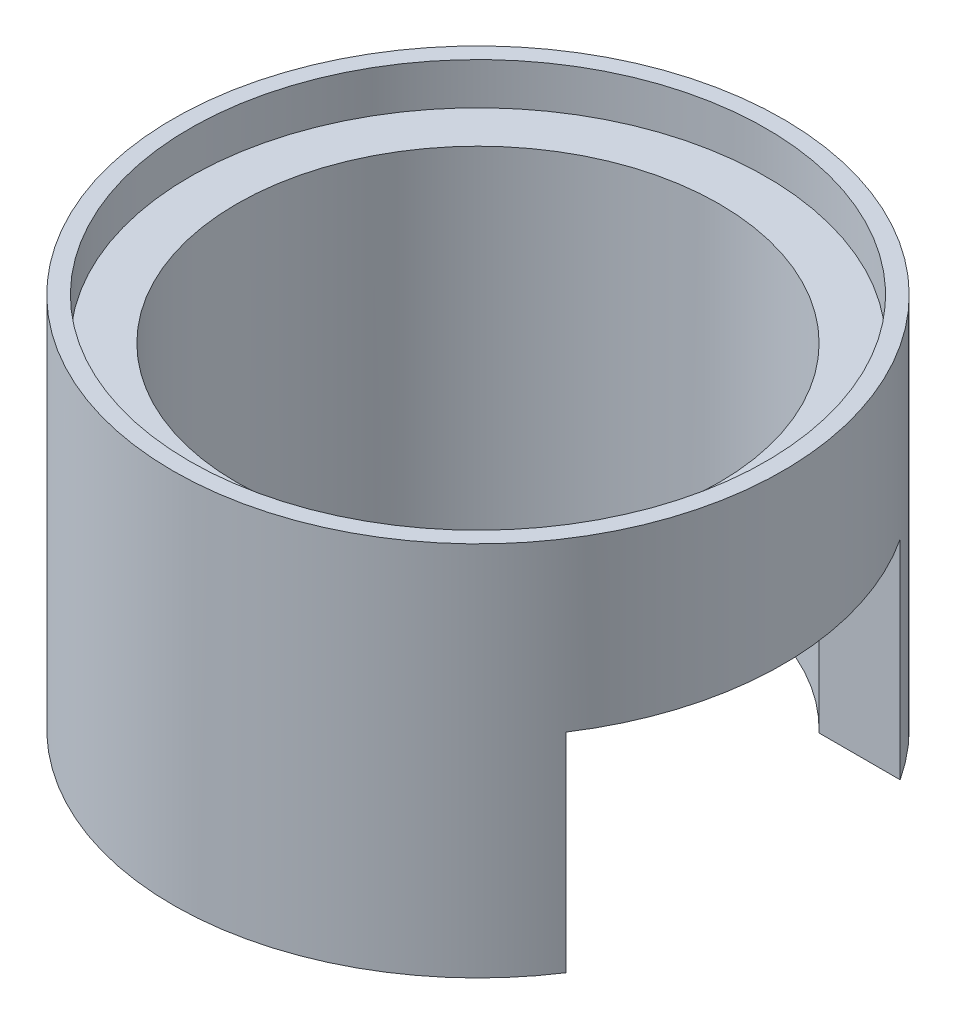
ISO-10303-21;
HEADER;
FILE_DESCRIPTION(('STEP AP214'),'2;1');
FILE_NAME('part.step','',(''),(''),'','','');
FILE_SCHEMA(('AUTOMOTIVE_DESIGN { 1 0 10303 214 1 1 1 1 }'));
ENDSEC;
DATA;
#1=APPLICATION_CONTEXT('core data for automotive mechanical design processes');
#2=APPLICATION_PROTOCOL_DEFINITION('international standard','automotive_design',2000,#1);
#3=PRODUCT_CONTEXT('',#1,'mechanical');
#4=PRODUCT('Part','Part','',(#3));
#5=PRODUCT_RELATED_PRODUCT_CATEGORY('part','',(#4));
#6=PRODUCT_DEFINITION_FORMATION('','',#4);
#7=PRODUCT_DEFINITION_CONTEXT('part definition',#1,'design');
#8=PRODUCT_DEFINITION('design','',#6,#7);
#9=PRODUCT_DEFINITION_SHAPE('','',#8);
#10=(LENGTH_UNIT() NAMED_UNIT(*) SI_UNIT(.MILLI.,.METRE.));
#11=(NAMED_UNIT(*) PLANE_ANGLE_UNIT() SI_UNIT($,.RADIAN.));
#12=(NAMED_UNIT(*) SI_UNIT($,.STERADIAN.) SOLID_ANGLE_UNIT());
#13=UNCERTAINTY_MEASURE_WITH_UNIT(LENGTH_MEASURE(1.E-05),#10,'distance_accuracy_value','');
#14=(GEOMETRIC_REPRESENTATION_CONTEXT(3) GLOBAL_UNCERTAINTY_ASSIGNED_CONTEXT((#13)) GLOBAL_UNIT_ASSIGNED_CONTEXT((#10,
#11,#12)) REPRESENTATION_CONTEXT('',''));
#15=CARTESIAN_POINT('',(0.,0.,0.));
#16=DIRECTION('',(0.,0.,1.));
#17=DIRECTION('',(1.,0.,0.));
#18=AXIS2_PLACEMENT_3D('',#15,#16,#17);
#19=CARTESIAN_POINT('',(0.,9.,0.));
#20=DIRECTION('',(0.,-1.,0.));
#21=DIRECTION('',(0.,0.,-1.));
#22=AXIS2_PLACEMENT_3D('',#19,#20,#21);
#23=CYLINDRICAL_SURFACE('',#22,7.3);
#24=CARTESIAN_POINT('',(0.,9.,0.));
#25=DIRECTION('',(0.,1.,0.));
#26=DIRECTION('',(0.,0.,1.));
#27=AXIS2_PLACEMENT_3D('',#24,#25,#26);
#28=CIRCLE('',#27,7.3);
#29=CARTESIAN_POINT('',(0.,9.,7.3));
#30=VERTEX_POINT('',#29);
#31=EDGE_CURVE('E88',#30,#30,#28,.T.);
#32=ORIENTED_EDGE('',*,*,#31,.F.);
#33=EDGE_LOOP('',(#32));
#34=FACE_BOUND('',#33,.T.);
#35=CARTESIAN_POINT('',(0.,4.98921657471197,0.));
#36=DIRECTION('',(0.,-1.,0.));
#37=DIRECTION('',(0.,0.,-1.));
#38=AXIS2_PLACEMENT_3D('',#35,#36,#37);
#39=CIRCLE('',#38,7.3);
#40=CARTESIAN_POINT('',(6.10655385630881,4.98921657471197,-4.));
#41=VERTEX_POINT('',#40);
#42=CARTESIAN_POINT('',(6.10655385630881,4.98921657471197,4.));
#43=VERTEX_POINT('',#42);
#44=EDGE_CURVE('E93',#41,#43,#39,.T.);
#45=ORIENTED_EDGE('',*,*,#44,.F.);
#46=DIRECTION('',(0.,-1.,0.));
#47=VECTOR('',#46,1.);
#48=CARTESIAN_POINT('',(6.10655385630881,9.,-4.));
#49=LINE('',#48,#47);
#50=CARTESIAN_POINT('',(6.10655385630881,0.,-4.));
#51=VERTEX_POINT('',#50);
#52=EDGE_CURVE('E63',#51,#41,#49,.F.);
#53=ORIENTED_EDGE('',*,*,#52,.F.);
#54=CARTESIAN_POINT('',(0.,0.,0.));
#55=DIRECTION('',(0.,1.,0.));
#56=DIRECTION('',(0.,0.,1.));
#57=AXIS2_PLACEMENT_3D('',#54,#55,#56);
#58=CIRCLE('',#57,7.3);
#59=CARTESIAN_POINT('',(6.10655385630881,0.,4.));
#60=VERTEX_POINT('',#59);
#61=EDGE_CURVE('E98',#51,#60,#58,.T.);
#62=ORIENTED_EDGE('',*,*,#61,.T.);
#63=DIRECTION('',(0.,-1.,0.));
#64=VECTOR('',#63,1.);
#65=CARTESIAN_POINT('',(6.10655385630881,9.,4.));
#66=LINE('',#65,#64);
#67=EDGE_CURVE('E116',#43,#60,#66,.T.);
#68=ORIENTED_EDGE('',*,*,#67,.F.);
#69=EDGE_LOOP('',(#45,#53,#62,#68));
#70=FACE_BOUND('',#69,.T.);
#71=ADVANCED_FACE('F41',(#34,#70),#23,.T.);
#72=CARTESIAN_POINT('',(0.,0.,0.));
#73=DIRECTION('',(0.,1.,0.));
#74=DIRECTION('',(0.,0.,1.));
#75=AXIS2_PLACEMENT_3D('',#72,#73,#74);
#76=PLANE('',#75);
#77=DIRECTION('',(1.,0.,0.));
#78=VECTOR('',#77,1.);
#79=CARTESIAN_POINT('',(1.3,0.,-4.));
#80=LINE('',#79,#78);
#81=CARTESIAN_POINT('',(4.1654081432676,0.,-4.));
#82=VERTEX_POINT('',#81);
#83=EDGE_CURVE('E120',#82,#51,#80,.T.);
#84=ORIENTED_EDGE('',*,*,#83,.F.);
#85=CARTESIAN_POINT('',(0.,0.,0.));
#86=DIRECTION('',(0.,1.,0.));
#87=DIRECTION('',(0.,0.,1.));
#88=AXIS2_PLACEMENT_3D('',#85,#86,#87);
#89=CIRCLE('',#88,5.775);
#90=CARTESIAN_POINT('',(4.1654081432676,0.,4.));
#91=VERTEX_POINT('',#90);
#92=EDGE_CURVE('E107',#82,#91,#89,.T.);
#93=ORIENTED_EDGE('',*,*,#92,.T.);
#94=DIRECTION('',(1.,0.,0.));
#95=VECTOR('',#94,1.);
#96=CARTESIAN_POINT('',(1.3,0.,4.));
#97=LINE('',#96,#95);
#98=EDGE_CURVE('E55',#91,#60,#97,.T.);
#99=ORIENTED_EDGE('',*,*,#98,.T.);
#100=ORIENTED_EDGE('',*,*,#61,.F.);
#101=EDGE_LOOP('',(#84,#93,#99,#100));
#102=FACE_BOUND('',#101,.T.);
#103=ADVANCED_FACE('F126',(#102),#76,.F.);
#104=CARTESIAN_POINT('',(0.,0.,0.));
#105=DIRECTION('',(0.,1.,0.));
#106=DIRECTION('',(0.,0.,1.));
#107=AXIS2_PLACEMENT_3D('',#104,#105,#106);
#108=CYLINDRICAL_SURFACE('',#107,5.775);
#109=CARTESIAN_POINT('',(0.,8.,0.));
#110=DIRECTION('',(0.,1.,0.));
#111=DIRECTION('',(0.,0.,1.));
#112=AXIS2_PLACEMENT_3D('',#109,#110,#111);
#113=CIRCLE('',#112,5.775);
#114=CARTESIAN_POINT('',(0.,8.,5.775));
#115=VERTEX_POINT('',#114);
#116=EDGE_CURVE('E110',#115,#115,#113,.T.);
#117=ORIENTED_EDGE('',*,*,#116,.T.);
#118=EDGE_LOOP('',(#117));
#119=FACE_BOUND('',#118,.T.);
#120=DIRECTION('',(0.,1.,0.));
#121=VECTOR('',#120,1.);
#122=CARTESIAN_POINT('',(4.1654081432676,0.,-4.));
#123=LINE('',#122,#121);
#124=CARTESIAN_POINT('',(4.1654081432676,4.98921657471197,-4.));
#125=VERTEX_POINT('',#124);
#126=EDGE_CURVE('E11',#125,#82,#123,.F.);
#127=ORIENTED_EDGE('',*,*,#126,.F.);
#128=CARTESIAN_POINT('',(0.,4.98921657471197,0.));
#129=DIRECTION('',(0.,-1.,0.));
#130=DIRECTION('',(0.,0.,-1.));
#131=AXIS2_PLACEMENT_3D('',#128,#129,#130);
#132=CIRCLE('',#131,5.775);
#133=CARTESIAN_POINT('',(4.1654081432676,4.98921657471197,4.));
#134=VERTEX_POINT('',#133);
#135=EDGE_CURVE('E48',#134,#125,#132,.F.);
#136=ORIENTED_EDGE('',*,*,#135,.F.);
#137=DIRECTION('',(0.,1.,0.));
#138=VECTOR('',#137,1.);
#139=CARTESIAN_POINT('',(4.1654081432676,0.,4.));
#140=LINE('',#139,#138);
#141=EDGE_CURVE('E79',#91,#134,#140,.T.);
#142=ORIENTED_EDGE('',*,*,#141,.F.);
#143=ORIENTED_EDGE('',*,*,#92,.F.);
#144=EDGE_LOOP('',(#127,#136,#142,#143));
#145=FACE_BOUND('',#144,.T.);
#146=ADVANCED_FACE('F96',(#119,#145),#108,.F.);
#147=CARTESIAN_POINT('',(0.,9.,0.));
#148=DIRECTION('',(0.,1.,0.));
#149=DIRECTION('',(0.,0.,1.));
#150=AXIS2_PLACEMENT_3D('',#147,#148,#149);
#151=PLANE('',#150);
#152=CARTESIAN_POINT('',(0.,9.,0.));
#153=DIRECTION('',(0.,1.,0.));
#154=DIRECTION('',(0.,0.,1.));
#155=AXIS2_PLACEMENT_3D('',#152,#153,#154);
#156=CIRCLE('',#155,6.9);
#157=CARTESIAN_POINT('',(0.,9.,6.9));
#158=VERTEX_POINT('',#157);
#159=EDGE_CURVE('E104',#158,#158,#156,.T.);
#160=ORIENTED_EDGE('',*,*,#159,.F.);
#161=EDGE_LOOP('',(#160));
#162=FACE_BOUND('',#161,.T.);
#163=ORIENTED_EDGE('',*,*,#31,.T.);
#164=EDGE_LOOP('',(#163));
#165=FACE_BOUND('',#164,.T.);
#166=ADVANCED_FACE('F145',(#162,#165),#151,.T.);
#167=CARTESIAN_POINT('',(0.,8.,0.));
#168=DIRECTION('',(0.,1.,0.));
#169=DIRECTION('',(0.,0.,1.));
#170=AXIS2_PLACEMENT_3D('',#167,#168,#169);
#171=CYLINDRICAL_SURFACE('',#170,6.9);
#172=CARTESIAN_POINT('',(0.,8.,0.));
#173=DIRECTION('',(0.,1.,0.));
#174=DIRECTION('',(0.,0.,1.));
#175=AXIS2_PLACEMENT_3D('',#172,#173,#174);
#176=CIRCLE('',#175,6.9);
#177=CARTESIAN_POINT('',(0.,8.,6.9));
#178=VERTEX_POINT('',#177);
#179=EDGE_CURVE('E101',#178,#178,#176,.T.);
#180=ORIENTED_EDGE('',*,*,#179,.F.);
#181=EDGE_LOOP('',(#180));
#182=FACE_BOUND('',#181,.T.);
#183=ORIENTED_EDGE('',*,*,#159,.T.);
#184=EDGE_LOOP('',(#183));
#185=FACE_BOUND('',#184,.T.);
#186=ADVANCED_FACE('F147',(#182,#185),#171,.F.);
#187=CARTESIAN_POINT('',(0.,8.,0.));
#188=DIRECTION('',(0.,1.,0.));
#189=DIRECTION('',(0.,0.,1.));
#190=AXIS2_PLACEMENT_3D('',#187,#188,#189);
#191=PLANE('',#190);
#192=ORIENTED_EDGE('',*,*,#116,.F.);
#193=EDGE_LOOP('',(#192));
#194=FACE_BOUND('',#193,.T.);
#195=ORIENTED_EDGE('',*,*,#179,.T.);
#196=EDGE_LOOP('',(#195));
#197=FACE_BOUND('',#196,.T.);
#198=ADVANCED_FACE('F135',(#194,#197),#191,.T.);
#199=CARTESIAN_POINT('',(1.3,4.98921657471197,0.));
#200=DIRECTION('',(0.,-1.,0.));
#201=DIRECTION('',(0.,0.,-1.));
#202=AXIS2_PLACEMENT_3D('',#199,#200,#201);
#203=PLANE('',#202);
#204=ORIENTED_EDGE('',*,*,#44,.T.);
#205=DIRECTION('',(1.,0.,0.));
#206=VECTOR('',#205,1.);
#207=CARTESIAN_POINT('',(1.3,4.98921657471197,4.));
#208=LINE('',#207,#206);
#209=EDGE_CURVE('E82',#134,#43,#208,.T.);
#210=ORIENTED_EDGE('',*,*,#209,.F.);
#211=ORIENTED_EDGE('',*,*,#135,.T.);
#212=DIRECTION('',(1.,0.,0.));
#213=VECTOR('',#212,1.);
#214=CARTESIAN_POINT('',(1.3,4.98921657471197,-4.));
#215=LINE('',#214,#213);
#216=EDGE_CURVE('E117',#125,#41,#215,.T.);
#217=ORIENTED_EDGE('',*,*,#216,.T.);
#218=EDGE_LOOP('',(#204,#210,#211,#217));
#219=FACE_BOUND('',#218,.T.);
#220=ADVANCED_FACE('F91',(#219),#203,.T.);
#221=CARTESIAN_POINT('',(1.3,0.,-4.));
#222=DIRECTION('',(0.,0.,1.));
#223=DIRECTION('',(1.,0.,0.));
#224=AXIS2_PLACEMENT_3D('',#221,#222,#223);
#225=PLANE('',#224);
#226=ORIENTED_EDGE('',*,*,#52,.T.);
#227=ORIENTED_EDGE('',*,*,#216,.F.);
#228=ORIENTED_EDGE('',*,*,#126,.T.);
#229=ORIENTED_EDGE('',*,*,#83,.T.);
#230=EDGE_LOOP('',(#226,#227,#228,#229));
#231=FACE_BOUND('',#230,.T.);
#232=ADVANCED_FACE('F127',(#231),#225,.T.);
#233=CARTESIAN_POINT('',(1.3,0.,4.));
#234=DIRECTION('',(0.,0.,-1.));
#235=DIRECTION('',(-1.,0.,0.));
#236=AXIS2_PLACEMENT_3D('',#233,#234,#235);
#237=PLANE('',#236);
#238=ORIENTED_EDGE('',*,*,#67,.T.);
#239=ORIENTED_EDGE('',*,*,#98,.F.);
#240=ORIENTED_EDGE('',*,*,#141,.T.);
#241=ORIENTED_EDGE('',*,*,#209,.T.);
#242=EDGE_LOOP('',(#238,#239,#240,#241));
#243=FACE_BOUND('',#242,.T.);
#244=ADVANCED_FACE('F81',(#243),#237,.T.);
#245=CLOSED_SHELL('',(#71,#103,#146,#166,#186,#198,#220,#232,#244));
#246=MANIFOLD_SOLID_BREP('B2',#245);
#247=ADVANCED_BREP_SHAPE_REPRESENTATION('',(#18,#246),#14);
#248=SHAPE_DEFINITION_REPRESENTATION(#9,#247);
ENDSEC;
END-ISO-10303-21;
